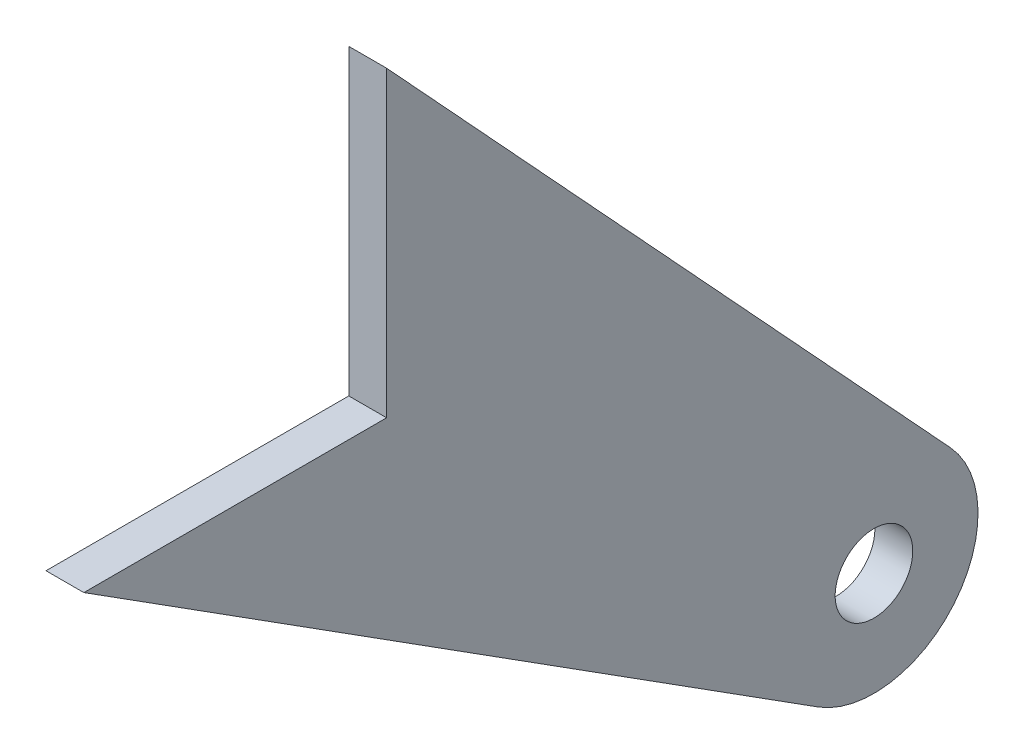
ISO-10303-21;
HEADER;
FILE_DESCRIPTION(('STEP AP214'),'2;1');
FILE_NAME('part.step','',(''),(''),'','','');
FILE_SCHEMA(('AUTOMOTIVE_DESIGN { 1 0 10303 214 1 1 1 1 }'));
ENDSEC;
DATA;
#1=APPLICATION_CONTEXT('core data for automotive mechanical design processes');
#2=APPLICATION_PROTOCOL_DEFINITION('international standard','automotive_design',2000,#1);
#3=PRODUCT_CONTEXT('',#1,'mechanical');
#4=PRODUCT('Part','Part','',(#3));
#5=PRODUCT_RELATED_PRODUCT_CATEGORY('part','',(#4));
#6=PRODUCT_DEFINITION_FORMATION('','',#4);
#7=PRODUCT_DEFINITION_CONTEXT('part definition',#1,'design');
#8=PRODUCT_DEFINITION('design','',#6,#7);
#9=PRODUCT_DEFINITION_SHAPE('','',#8);
#10=(LENGTH_UNIT() NAMED_UNIT(*) SI_UNIT(.MILLI.,.METRE.));
#11=(NAMED_UNIT(*) PLANE_ANGLE_UNIT() SI_UNIT($,.RADIAN.));
#12=(NAMED_UNIT(*) SI_UNIT($,.STERADIAN.) SOLID_ANGLE_UNIT());
#13=UNCERTAINTY_MEASURE_WITH_UNIT(LENGTH_MEASURE(1.E-05),#10,'distance_accuracy_value','');
#14=(GEOMETRIC_REPRESENTATION_CONTEXT(3) GLOBAL_UNCERTAINTY_ASSIGNED_CONTEXT((#13)) GLOBAL_UNIT_ASSIGNED_CONTEXT((#10,
#11,#12)) REPRESENTATION_CONTEXT('',''));
#15=CARTESIAN_POINT('',(0.,0.,0.));
#16=DIRECTION('',(0.,0.,1.));
#17=DIRECTION('',(1.,0.,0.));
#18=AXIS2_PLACEMENT_3D('',#15,#16,#17);
#19=CARTESIAN_POINT('',(-730.,-99.98,-433.77));
#20=DIRECTION('',(-1.,0.,0.));
#21=DIRECTION('',(0.,0.,1.));
#22=AXIS2_PLACEMENT_3D('',#19,#20,#21);
#23=PLANE('',#22);
#24=DIRECTION('',(0.,0.734668179220473,0.678426610946884));
#25=VECTOR('',#24,1.);
#26=CARTESIAN_POINT('',(-730.,80.,-305.));
#27=LINE('',#26,#25);
#28=CARTESIAN_POINT('',(-730.,-81.3232681989606,-453.973374928563));
#29=VERTEX_POINT('',#28);
#30=CARTESIAN_POINT('',(-730.,80.,-305.));
#31=VERTEX_POINT('',#30);
#32=EDGE_CURVE('E120',#29,#31,#27,.T.);
#33=ORIENTED_EDGE('',*,*,#32,.T.);
#34=DIRECTION('',(0.,-1.,0.));
#35=VECTOR('',#34,1.);
#36=CARTESIAN_POINT('',(-730.,80.,-305.));
#37=LINE('',#36,#35);
#38=CARTESIAN_POINT('',(-730.,0.,-305.));
#39=VERTEX_POINT('',#38);
#40=EDGE_CURVE('E87',#31,#39,#37,.T.);
#41=ORIENTED_EDGE('',*,*,#40,.T.);
#42=DIRECTION('',(0.,0.,1.));
#43=VECTOR('',#42,1.);
#44=CARTESIAN_POINT('',(-730.,0.,-305.));
#45=LINE('',#44,#43);
#46=CARTESIAN_POINT('',(-730.,0.,-225.));
#47=VERTEX_POINT('',#46);
#48=EDGE_CURVE('E91',#39,#47,#45,.T.);
#49=ORIENTED_EDGE('',*,*,#48,.T.);
#50=DIRECTION('',(0.,-0.536015404166071,-0.84420820091769));
#51=VECTOR('',#50,1.);
#52=CARTESIAN_POINT('',(-730.,0.,-225.));
#53=LINE('',#52,#51);
#54=CARTESIAN_POINT('',(-730.,-123.195725525236,-419.029576385433));
#55=VERTEX_POINT('',#54);
#56=EDGE_CURVE('E95',#47,#55,#53,.T.);
#57=ORIENTED_EDGE('',*,*,#56,.T.);
#58=CARTESIAN_POINT('',(-730.,-99.98,-433.77));
#59=DIRECTION('',(1.,0.,0.));
#60=DIRECTION('',(0.,0.,1.));
#61=AXIS2_PLACEMENT_3D('',#58,#59,#60);
#62=CIRCLE('',#61,27.5);
#63=EDGE_CURVE('E53',#55,#29,#62,.T.);
#64=ORIENTED_EDGE('',*,*,#63,.T.);
#65=EDGE_LOOP('',(#33,#41,#49,#57,#64));
#66=FACE_BOUND('',#65,.T.);
#67=CARTESIAN_POINT('',(-730.,-99.98,-433.77));
#68=DIRECTION('',(1.,0.,0.));
#69=DIRECTION('',(0.,0.,-1.));
#70=AXIS2_PLACEMENT_3D('',#67,#68,#69);
#71=CIRCLE('',#70,10.25);
#72=CARTESIAN_POINT('',(-730.,-99.98,-444.02));
#73=VERTEX_POINT('',#72);
#74=EDGE_CURVE('E115',#73,#73,#71,.T.);
#75=ORIENTED_EDGE('',*,*,#74,.F.);
#76=EDGE_LOOP('',(#75));
#77=FACE_BOUND('',#76,.T.);
#78=ADVANCED_FACE('F36',(#66,#77),#23,.F.);
#79=CARTESIAN_POINT('',(-740.,-99.98,-433.77));
#80=DIRECTION('',(-1.,0.,0.));
#81=DIRECTION('',(0.,0.,1.));
#82=AXIS2_PLACEMENT_3D('',#79,#80,#81);
#83=PLANE('',#82);
#84=DIRECTION('',(0.,0.734668179220473,0.678426610946884));
#85=VECTOR('',#84,1.);
#86=CARTESIAN_POINT('',(-740.,80.,-305.));
#87=LINE('',#86,#85);
#88=CARTESIAN_POINT('',(-740.,-81.3232681989606,-453.973374928563));
#89=VERTEX_POINT('',#88);
#90=CARTESIAN_POINT('',(-740.,80.,-305.));
#91=VERTEX_POINT('',#90);
#92=EDGE_CURVE('E111',#89,#91,#87,.T.);
#93=ORIENTED_EDGE('',*,*,#92,.F.);
#94=CARTESIAN_POINT('',(-740.,-99.98,-433.77));
#95=DIRECTION('',(1.,0.,0.));
#96=DIRECTION('',(0.,0.,1.));
#97=AXIS2_PLACEMENT_3D('',#94,#95,#96);
#98=CIRCLE('',#97,27.5);
#99=CARTESIAN_POINT('',(-740.,-123.195725525236,-419.029576385433));
#100=VERTEX_POINT('',#99);
#101=EDGE_CURVE('E79',#100,#89,#98,.T.);
#102=ORIENTED_EDGE('',*,*,#101,.F.);
#103=DIRECTION('',(0.,-0.536015404166071,-0.84420820091769));
#104=VECTOR('',#103,1.);
#105=CARTESIAN_POINT('',(-740.,0.,-225.));
#106=LINE('',#105,#104);
#107=CARTESIAN_POINT('',(-740.,0.,-225.));
#108=VERTEX_POINT('',#107);
#109=EDGE_CURVE('E73',#108,#100,#106,.T.);
#110=ORIENTED_EDGE('',*,*,#109,.F.);
#111=DIRECTION('',(0.,0.,1.));
#112=VECTOR('',#111,1.);
#113=CARTESIAN_POINT('',(-740.,0.,-305.));
#114=LINE('',#113,#112);
#115=CARTESIAN_POINT('',(-740.,0.,-305.));
#116=VERTEX_POINT('',#115);
#117=EDGE_CURVE('E102',#116,#108,#114,.T.);
#118=ORIENTED_EDGE('',*,*,#117,.F.);
#119=DIRECTION('',(0.,-1.,0.));
#120=VECTOR('',#119,1.);
#121=CARTESIAN_POINT('',(-740.,80.,-305.));
#122=LINE('',#121,#120);
#123=EDGE_CURVE('E114',#91,#116,#122,.T.);
#124=ORIENTED_EDGE('',*,*,#123,.F.);
#125=EDGE_LOOP('',(#93,#102,#110,#118,#124));
#126=FACE_BOUND('',#125,.T.);
#127=CARTESIAN_POINT('',(-740.,-99.98,-433.77));
#128=DIRECTION('',(1.,0.,0.));
#129=DIRECTION('',(0.,0.,-1.));
#130=AXIS2_PLACEMENT_3D('',#127,#128,#129);
#131=CIRCLE('',#130,10.25);
#132=CARTESIAN_POINT('',(-740.,-99.98,-444.02));
#133=VERTEX_POINT('',#132);
#134=EDGE_CURVE('E216',#133,#133,#131,.T.);
#135=ORIENTED_EDGE('',*,*,#134,.T.);
#136=EDGE_LOOP('',(#135));
#137=FACE_BOUND('',#136,.T.);
#138=ADVANCED_FACE('F124',(#126,#137),#83,.T.);
#139=CARTESIAN_POINT('',(-730.,80.,-305.));
#140=DIRECTION('',(0.,-0.678426610946884,0.734668179220473));
#141=DIRECTION('',(0.,-0.734668179220473,-0.678426610946885));
#142=AXIS2_PLACEMENT_3D('',#139,#140,#141);
#143=PLANE('',#142);
#144=ORIENTED_EDGE('',*,*,#92,.T.);
#145=DIRECTION('',(-1.,0.,0.));
#146=VECTOR('',#145,1.);
#147=CARTESIAN_POINT('',(-730.,80.,-305.));
#148=LINE('',#147,#146);
#149=EDGE_CURVE('E11',#31,#91,#148,.T.);
#150=ORIENTED_EDGE('',*,*,#149,.F.);
#151=ORIENTED_EDGE('',*,*,#32,.F.);
#152=DIRECTION('',(-1.,0.,0.));
#153=VECTOR('',#152,1.);
#154=CARTESIAN_POINT('',(-730.,-81.3232681989606,-453.973374928563));
#155=LINE('',#154,#153);
#156=EDGE_CURVE('E107',#29,#89,#155,.T.);
#157=ORIENTED_EDGE('',*,*,#156,.T.);
#158=EDGE_LOOP('',(#144,#150,#151,#157));
#159=FACE_BOUND('',#158,.T.);
#160=ADVANCED_FACE('F38',(#159),#143,.F.);
#161=CARTESIAN_POINT('',(-730.,80.,-305.));
#162=DIRECTION('',(0.,0.,-1.));
#163=DIRECTION('',(-1.,0.,0.));
#164=AXIS2_PLACEMENT_3D('',#161,#162,#163);
#165=PLANE('',#164);
#166=ORIENTED_EDGE('',*,*,#123,.T.);
#167=DIRECTION('',(-1.,0.,0.));
#168=VECTOR('',#167,1.);
#169=CARTESIAN_POINT('',(-730.,0.,-305.));
#170=LINE('',#169,#168);
#171=EDGE_CURVE('E45',#39,#116,#170,.T.);
#172=ORIENTED_EDGE('',*,*,#171,.F.);
#173=ORIENTED_EDGE('',*,*,#40,.F.);
#174=ORIENTED_EDGE('',*,*,#149,.T.);
#175=EDGE_LOOP('',(#166,#172,#173,#174));
#176=FACE_BOUND('',#175,.T.);
#177=ADVANCED_FACE('F149',(#176),#165,.F.);
#178=CARTESIAN_POINT('',(-730.,0.,-305.));
#179=DIRECTION('',(0.,-1.,0.));
#180=DIRECTION('',(0.,0.,-1.));
#181=AXIS2_PLACEMENT_3D('',#178,#179,#180);
#182=PLANE('',#181);
#183=ORIENTED_EDGE('',*,*,#117,.T.);
#184=DIRECTION('',(-1.,0.,0.));
#185=VECTOR('',#184,1.);
#186=CARTESIAN_POINT('',(-730.,0.,-225.));
#187=LINE('',#186,#185);
#188=EDGE_CURVE('E99',#47,#108,#187,.T.);
#189=ORIENTED_EDGE('',*,*,#188,.F.);
#190=ORIENTED_EDGE('',*,*,#48,.F.);
#191=ORIENTED_EDGE('',*,*,#171,.T.);
#192=EDGE_LOOP('',(#183,#189,#190,#191));
#193=FACE_BOUND('',#192,.T.);
#194=ADVANCED_FACE('F100',(#193),#182,.F.);
#195=CARTESIAN_POINT('',(-730.,0.,-225.));
#196=DIRECTION('',(0.,0.84420820091769,-0.536015404166071));
#197=DIRECTION('',(0.,0.536015404166071,0.84420820091769));
#198=AXIS2_PLACEMENT_3D('',#195,#196,#197);
#199=PLANE('',#198);
#200=ORIENTED_EDGE('',*,*,#109,.T.);
#201=DIRECTION('',(-1.,0.,0.));
#202=VECTOR('',#201,1.);
#203=CARTESIAN_POINT('',(-730.,-123.195725525236,-419.029576385433));
#204=LINE('',#203,#202);
#205=EDGE_CURVE('E103',#55,#100,#204,.T.);
#206=ORIENTED_EDGE('',*,*,#205,.F.);
#207=ORIENTED_EDGE('',*,*,#56,.F.);
#208=ORIENTED_EDGE('',*,*,#188,.T.);
#209=EDGE_LOOP('',(#200,#206,#207,#208));
#210=FACE_BOUND('',#209,.T.);
#211=ADVANCED_FACE('F105',(#210),#199,.F.);
#212=CARTESIAN_POINT('',(-730.,-99.98,-433.77));
#213=DIRECTION('',(-1.,0.,0.));
#214=DIRECTION('',(0.,0.,1.));
#215=AXIS2_PLACEMENT_3D('',#212,#213,#214);
#216=CYLINDRICAL_SURFACE('',#215,27.5);
#217=ORIENTED_EDGE('',*,*,#101,.T.);
#218=ORIENTED_EDGE('',*,*,#156,.F.);
#219=ORIENTED_EDGE('',*,*,#63,.F.);
#220=ORIENTED_EDGE('',*,*,#205,.T.);
#221=EDGE_LOOP('',(#217,#218,#219,#220));
#222=FACE_BOUND('',#221,.T.);
#223=ADVANCED_FACE('F129',(#222),#216,.T.);
#224=CARTESIAN_POINT('',(-730.,-99.98,-433.77));
#225=DIRECTION('',(-1.,0.,0.));
#226=DIRECTION('',(0.,0.,1.));
#227=AXIS2_PLACEMENT_3D('',#224,#225,#226);
#228=CYLINDRICAL_SURFACE('',#227,10.25);
#229=ORIENTED_EDGE('',*,*,#74,.T.);
#230=EDGE_LOOP('',(#229));
#231=FACE_BOUND('',#230,.T.);
#232=ORIENTED_EDGE('',*,*,#134,.F.);
#233=EDGE_LOOP('',(#232));
#234=FACE_BOUND('',#233,.T.);
#235=ADVANCED_FACE('F131',(#231,#234),#228,.F.);
#236=CLOSED_SHELL('',(#78,#138,#160,#177,#194,#211,#223,#235));
#237=MANIFOLD_SOLID_BREP('B2',#236);
#238=ADVANCED_BREP_SHAPE_REPRESENTATION('',(#18,#237),#14);
#239=SHAPE_DEFINITION_REPRESENTATION(#9,#238);
ENDSEC;
END-ISO-10303-21;
